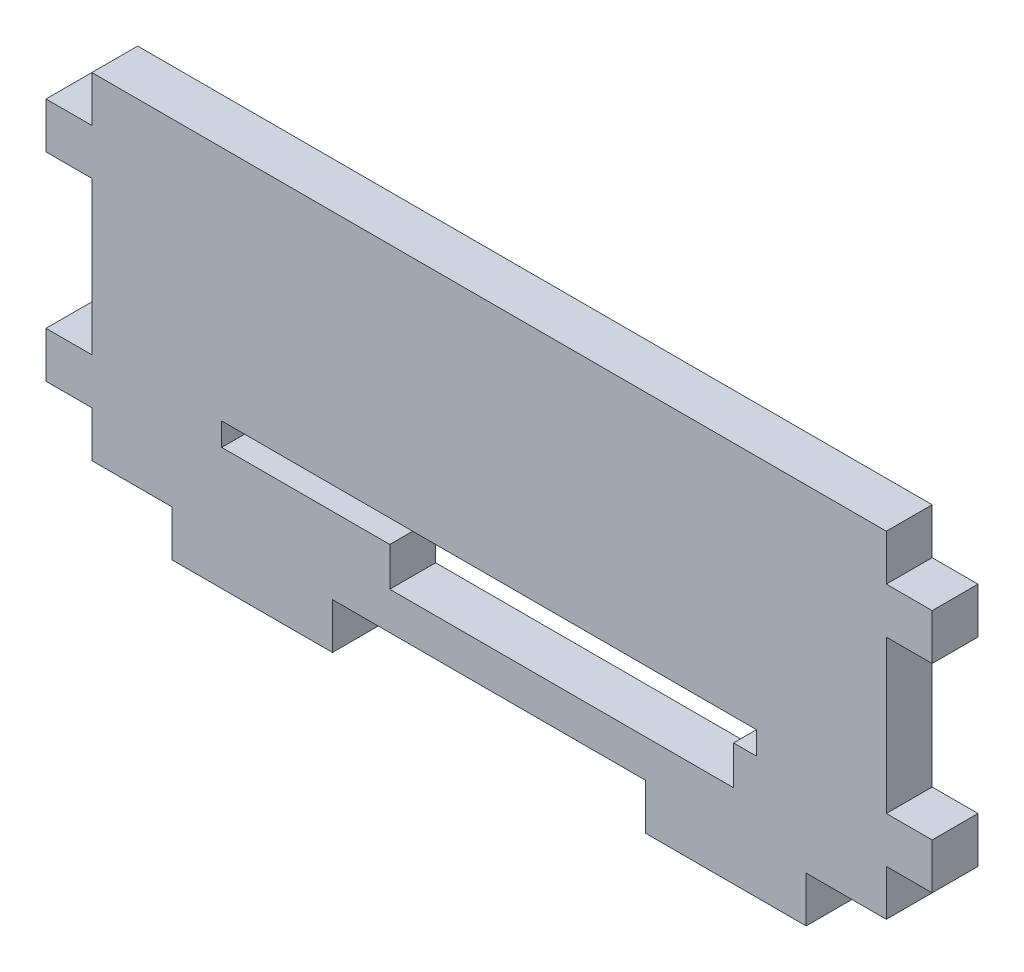
ISO-10303-21;
HEADER;
FILE_DESCRIPTION(('STEP AP214'),'2;1');
FILE_NAME('part.step','',(''),(''),'','','');
FILE_SCHEMA(('AUTOMOTIVE_DESIGN { 1 0 10303 214 1 1 1 1 }'));
ENDSEC;
DATA;
#1=APPLICATION_CONTEXT('core data for automotive mechanical design processes');
#2=APPLICATION_PROTOCOL_DEFINITION('international standard','automotive_design',2000,#1);
#3=PRODUCT_CONTEXT('',#1,'mechanical');
#4=PRODUCT('Part','Part','',(#3));
#5=PRODUCT_RELATED_PRODUCT_CATEGORY('part','',(#4));
#6=PRODUCT_DEFINITION_FORMATION('','',#4);
#7=PRODUCT_DEFINITION_CONTEXT('part definition',#1,'design');
#8=PRODUCT_DEFINITION('design','',#6,#7);
#9=PRODUCT_DEFINITION_SHAPE('','',#8);
#10=(LENGTH_UNIT() NAMED_UNIT(*) SI_UNIT(.MILLI.,.METRE.));
#11=(NAMED_UNIT(*) PLANE_ANGLE_UNIT() SI_UNIT($,.RADIAN.));
#12=(NAMED_UNIT(*) SI_UNIT($,.STERADIAN.) SOLID_ANGLE_UNIT());
#13=UNCERTAINTY_MEASURE_WITH_UNIT(LENGTH_MEASURE(1.E-05),#10,'distance_accuracy_value','');
#14=(GEOMETRIC_REPRESENTATION_CONTEXT(3) GLOBAL_UNCERTAINTY_ASSIGNED_CONTEXT((#13)) GLOBAL_UNIT_ASSIGNED_CONTEXT((#10,
#11,#12)) REPRESENTATION_CONTEXT('',''));
#15=CARTESIAN_POINT('',(0.,0.,0.));
#16=DIRECTION('',(0.,0.,1.));
#17=DIRECTION('',(1.,0.,0.));
#18=AXIS2_PLACEMENT_3D('',#15,#16,#17);
#19=CARTESIAN_POINT('',(-17.5,-6.,0.));
#20=DIRECTION('',(0.,-1.,0.));
#21=DIRECTION('',(0.,0.,-1.));
#22=AXIS2_PLACEMENT_3D('',#19,#20,#21);
#23=PLANE('',#22);
#24=DIRECTION('',(1.,0.,0.));
#25=VECTOR('',#24,1.);
#26=CARTESIAN_POINT('',(-17.5,-6.,3.));
#27=LINE('',#26,#25);
#28=CARTESIAN_POINT('',(-17.5,-6.,3.));
#29=VERTEX_POINT('',#28);
#30=CARTESIAN_POINT('',(-6.50000000000001,-6.,3.));
#31=VERTEX_POINT('',#30);
#32=EDGE_CURVE('E318',#29,#31,#27,.T.);
#33=ORIENTED_EDGE('',*,*,#32,.T.);
#34=DIRECTION('',(0.,0.,1.));
#35=VECTOR('',#34,1.);
#36=CARTESIAN_POINT('',(-6.50000000000001,-6.,0.));
#37=LINE('',#36,#35);
#38=CARTESIAN_POINT('',(-6.50000000000001,-6.,0.));
#39=VERTEX_POINT('',#38);
#40=EDGE_CURVE('E299',#39,#31,#37,.T.);
#41=ORIENTED_EDGE('',*,*,#40,.F.);
#42=DIRECTION('',(1.,0.,0.));
#43=VECTOR('',#42,1.);
#44=CARTESIAN_POINT('',(-17.5,-6.,0.));
#45=LINE('',#44,#43);
#46=CARTESIAN_POINT('',(-17.5,-6.,0.));
#47=VERTEX_POINT('',#46);
#48=EDGE_CURVE('E291',#47,#39,#45,.T.);
#49=ORIENTED_EDGE('',*,*,#48,.F.);
#50=DIRECTION('',(0.,0.,1.));
#51=VECTOR('',#50,1.);
#52=CARTESIAN_POINT('',(-17.5,-6.,0.));
#53=LINE('',#52,#51);
#54=EDGE_CURVE('E315',#47,#29,#53,.T.);
#55=ORIENTED_EDGE('',*,*,#54,.T.);
#56=EDGE_LOOP('',(#33,#41,#49,#55));
#57=FACE_BOUND('',#56,.T.);
#58=ADVANCED_FACE('F33',(#57),#23,.F.);
#59=CARTESIAN_POINT('',(-26.,-11.,3.));
#60=DIRECTION('',(0.,1.,0.));
#61=DIRECTION('',(0.,0.,1.));
#62=AXIS2_PLACEMENT_3D('',#59,#60,#61);
#63=PLANE('',#62);
#64=DIRECTION('',(0.,0.,-1.));
#65=VECTOR('',#64,1.);
#66=CARTESIAN_POINT('',(10.25,-11.,3.));
#67=LINE('',#66,#65);
#68=CARTESIAN_POINT('',(10.25,-11.,3.));
#69=VERTEX_POINT('',#68);
#70=CARTESIAN_POINT('',(10.25,-11.,0.));
#71=VERTEX_POINT('',#70);
#72=EDGE_CURVE('E328',#69,#71,#67,.T.);
#73=ORIENTED_EDGE('',*,*,#72,.F.);
#74=DIRECTION('',(1.,0.,0.));
#75=VECTOR('',#74,1.);
#76=CARTESIAN_POINT('',(-26.,-11.,3.));
#77=LINE('',#76,#75);
#78=CARTESIAN_POINT('',(-10.25,-11.,3.));
#79=VERTEX_POINT('',#78);
#80=EDGE_CURVE('E514',#79,#69,#77,.T.);
#81=ORIENTED_EDGE('',*,*,#80,.F.);
#82=DIRECTION('',(0.,0.,1.));
#83=VECTOR('',#82,1.);
#84=CARTESIAN_POINT('',(-10.25,-11.,3.));
#85=LINE('',#84,#83);
#86=CARTESIAN_POINT('',(-10.25,-11.,0.));
#87=VERTEX_POINT('',#86);
#88=EDGE_CURVE('E366',#87,#79,#85,.T.);
#89=ORIENTED_EDGE('',*,*,#88,.F.);
#90=DIRECTION('',(1.,0.,0.));
#91=VECTOR('',#90,1.);
#92=CARTESIAN_POINT('',(-26.,-11.,0.));
#93=LINE('',#92,#91);
#94=EDGE_CURVE('E527',#87,#71,#93,.T.);
#95=ORIENTED_EDGE('',*,*,#94,.T.);
#96=EDGE_LOOP('',(#73,#81,#89,#95));
#97=FACE_BOUND('',#96,.T.);
#98=ADVANCED_FACE('F608',(#97),#63,.F.);
#99=DIRECTION('',(0.,0.,1.));
#100=VECTOR('',#99,1.);
#101=CARTESIAN_POINT('',(20.75,-11.,3.));
#102=LINE('',#101,#100);
#103=CARTESIAN_POINT('',(20.75,-11.,0.));
#104=VERTEX_POINT('',#103);
#105=CARTESIAN_POINT('',(20.75,-11.,3.));
#106=VERTEX_POINT('',#105);
#107=EDGE_CURVE('E339',#104,#106,#102,.T.);
#108=ORIENTED_EDGE('',*,*,#107,.F.);
#109=CARTESIAN_POINT('',(26.,-11.,0.));
#110=VERTEX_POINT('',#109);
#111=EDGE_CURVE('E523',#104,#110,#93,.T.);
#112=ORIENTED_EDGE('',*,*,#111,.T.);
#113=DIRECTION('',(0.,0.,-1.));
#114=VECTOR('',#113,1.);
#115=CARTESIAN_POINT('',(26.,-11.,3.));
#116=LINE('',#115,#114);
#117=CARTESIAN_POINT('',(26.,-11.,3.));
#118=VERTEX_POINT('',#117);
#119=EDGE_CURVE('E513',#118,#110,#116,.T.);
#120=ORIENTED_EDGE('',*,*,#119,.F.);
#121=EDGE_CURVE('E508',#106,#118,#77,.T.);
#122=ORIENTED_EDGE('',*,*,#121,.F.);
#123=EDGE_LOOP('',(#108,#112,#120,#122));
#124=FACE_BOUND('',#123,.T.);
#125=ADVANCED_FACE('F592',(#124),#63,.F.);
#126=DIRECTION('',(0.,0.,-1.));
#127=VECTOR('',#126,1.);
#128=CARTESIAN_POINT('',(-20.75,-11.,3.));
#129=LINE('',#128,#127);
#130=CARTESIAN_POINT('',(-20.75,-11.,3.));
#131=VERTEX_POINT('',#130);
#132=CARTESIAN_POINT('',(-20.75,-11.,0.));
#133=VERTEX_POINT('',#132);
#134=EDGE_CURVE('E361',#131,#133,#129,.T.);
#135=ORIENTED_EDGE('',*,*,#134,.F.);
#136=CARTESIAN_POINT('',(-26.,-11.,3.));
#137=VERTEX_POINT('',#136);
#138=EDGE_CURVE('E510',#137,#131,#77,.T.);
#139=ORIENTED_EDGE('',*,*,#138,.F.);
#140=DIRECTION('',(0.,0.,-1.));
#141=VECTOR('',#140,1.);
#142=CARTESIAN_POINT('',(-26.,-11.,3.));
#143=LINE('',#142,#141);
#144=CARTESIAN_POINT('',(-26.,-11.,0.));
#145=VERTEX_POINT('',#144);
#146=EDGE_CURVE('E530',#137,#145,#143,.T.);
#147=ORIENTED_EDGE('',*,*,#146,.T.);
#148=EDGE_CURVE('E525',#145,#133,#93,.T.);
#149=ORIENTED_EDGE('',*,*,#148,.T.);
#150=EDGE_LOOP('',(#135,#139,#147,#149));
#151=FACE_BOUND('',#150,.T.);
#152=ADVANCED_FACE('F624',(#151),#63,.F.);
#153=CARTESIAN_POINT('',(26.,11.,3.));
#154=DIRECTION('',(-1.,0.,0.));
#155=DIRECTION('',(0.,0.,1.));
#156=AXIS2_PLACEMENT_3D('',#153,#154,#155);
#157=PLANE('',#156);
#158=DIRECTION('',(0.,0.,-1.));
#159=VECTOR('',#158,1.);
#160=CARTESIAN_POINT('',(26.,-8.,3.));
#161=LINE('',#160,#159);
#162=CARTESIAN_POINT('',(26.,-7.99999999999999,3.));
#163=VERTEX_POINT('',#162);
#164=CARTESIAN_POINT('',(26.,-7.99999999999999,0.));
#165=VERTEX_POINT('',#164);
#166=EDGE_CURVE('E388',#163,#165,#161,.T.);
#167=ORIENTED_EDGE('',*,*,#166,.F.);
#168=DIRECTION('',(0.,1.,0.));
#169=VECTOR('',#168,1.);
#170=CARTESIAN_POINT('',(26.,11.,3.));
#171=LINE('',#170,#169);
#172=EDGE_CURVE('E497',#118,#163,#171,.T.);
#173=ORIENTED_EDGE('',*,*,#172,.F.);
#174=ORIENTED_EDGE('',*,*,#119,.T.);
#175=DIRECTION('',(0.,1.,0.));
#176=VECTOR('',#175,1.);
#177=CARTESIAN_POINT('',(26.,11.,0.));
#178=LINE('',#177,#176);
#179=EDGE_CURVE('E515',#110,#165,#178,.T.);
#180=ORIENTED_EDGE('',*,*,#179,.T.);
#181=EDGE_LOOP('',(#167,#173,#174,#180));
#182=FACE_BOUND('',#181,.T.);
#183=ADVANCED_FACE('F586',(#182),#157,.F.);
#184=DIRECTION('',(0.,0.,1.));
#185=VECTOR('',#184,1.);
#186=CARTESIAN_POINT('',(26.,-5.,3.));
#187=LINE('',#186,#185);
#188=CARTESIAN_POINT('',(26.,-5.,0.));
#189=VERTEX_POINT('',#188);
#190=CARTESIAN_POINT('',(26.,-5.,3.));
#191=VERTEX_POINT('',#190);
#192=EDGE_CURVE('E393',#189,#191,#187,.T.);
#193=ORIENTED_EDGE('',*,*,#192,.F.);
#194=CARTESIAN_POINT('',(26.,5.,0.));
#195=VERTEX_POINT('',#194);
#196=EDGE_CURVE('E518',#189,#195,#178,.T.);
#197=ORIENTED_EDGE('',*,*,#196,.T.);
#198=DIRECTION('',(0.,0.,-1.));
#199=VECTOR('',#198,1.);
#200=CARTESIAN_POINT('',(26.,5.,3.));
#201=LINE('',#200,#199);
#202=CARTESIAN_POINT('',(26.,5.,3.));
#203=VERTEX_POINT('',#202);
#204=EDGE_CURVE('E415',#203,#195,#201,.T.);
#205=ORIENTED_EDGE('',*,*,#204,.F.);
#206=EDGE_CURVE('E501',#191,#203,#171,.T.);
#207=ORIENTED_EDGE('',*,*,#206,.F.);
#208=EDGE_LOOP('',(#193,#197,#205,#207));
#209=FACE_BOUND('',#208,.T.);
#210=ADVANCED_FACE('F560',(#209),#157,.F.);
#211=DIRECTION('',(0.,0.,1.));
#212=VECTOR('',#211,1.);
#213=CARTESIAN_POINT('',(26.,8.,3.));
#214=LINE('',#213,#212);
#215=CARTESIAN_POINT('',(26.,8.,0.));
#216=VERTEX_POINT('',#215);
#217=CARTESIAN_POINT('',(26.,8.,3.));
#218=VERTEX_POINT('',#217);
#219=EDGE_CURVE('E420',#216,#218,#214,.T.);
#220=ORIENTED_EDGE('',*,*,#219,.F.);
#221=CARTESIAN_POINT('',(26.,11.,0.));
#222=VERTEX_POINT('',#221);
#223=EDGE_CURVE('E496',#216,#222,#178,.T.);
#224=ORIENTED_EDGE('',*,*,#223,.T.);
#225=DIRECTION('',(0.,0.,-1.));
#226=VECTOR('',#225,1.);
#227=CARTESIAN_POINT('',(26.,11.,3.));
#228=LINE('',#227,#226);
#229=CARTESIAN_POINT('',(26.,11.,3.));
#230=VERTEX_POINT('',#229);
#231=EDGE_CURVE('E11',#230,#222,#228,.T.);
#232=ORIENTED_EDGE('',*,*,#231,.F.);
#233=EDGE_CURVE('E502',#218,#230,#171,.T.);
#234=ORIENTED_EDGE('',*,*,#233,.F.);
#235=EDGE_LOOP('',(#220,#224,#232,#234));
#236=FACE_BOUND('',#235,.T.);
#237=ADVANCED_FACE('F35',(#236),#157,.F.);
#238=CARTESIAN_POINT('',(-26.,11.,3.));
#239=DIRECTION('',(1.,0.,0.));
#240=DIRECTION('',(0.,1.,0.));
#241=AXIS2_PLACEMENT_3D('',#238,#239,#240);
#242=PLANE('',#241);
#243=DIRECTION('',(0.,0.,1.));
#244=VECTOR('',#243,1.);
#245=CARTESIAN_POINT('',(-26.,-8.,0.));
#246=LINE('',#245,#244);
#247=CARTESIAN_POINT('',(-26.,-8.,0.));
#248=VERTEX_POINT('',#247);
#249=CARTESIAN_POINT('',(-26.,-7.99999999999999,3.));
#250=VERTEX_POINT('',#249);
#251=EDGE_CURVE('E442',#248,#250,#246,.T.);
#252=ORIENTED_EDGE('',*,*,#251,.F.);
#253=DIRECTION('',(0.,-1.,0.));
#254=VECTOR('',#253,1.);
#255=CARTESIAN_POINT('',(-26.,11.,0.));
#256=LINE('',#255,#254);
#257=EDGE_CURVE('E520',#248,#145,#256,.T.);
#258=ORIENTED_EDGE('',*,*,#257,.T.);
#259=ORIENTED_EDGE('',*,*,#146,.F.);
#260=DIRECTION('',(0.,-1.,0.));
#261=VECTOR('',#260,1.);
#262=CARTESIAN_POINT('',(-26.,11.,3.));
#263=LINE('',#262,#261);
#264=EDGE_CURVE('E504',#250,#137,#263,.T.);
#265=ORIENTED_EDGE('',*,*,#264,.F.);
#266=EDGE_LOOP('',(#252,#258,#259,#265));
#267=FACE_BOUND('',#266,.T.);
#268=ADVANCED_FACE('F630',(#267),#242,.F.);
#269=DIRECTION('',(0.,0.,-1.));
#270=VECTOR('',#269,1.);
#271=CARTESIAN_POINT('',(-26.,-5.,0.));
#272=LINE('',#271,#270);
#273=CARTESIAN_POINT('',(-26.,-5.,3.));
#274=VERTEX_POINT('',#273);
#275=CARTESIAN_POINT('',(-26.,-5.,0.));
#276=VERTEX_POINT('',#275);
#277=EDGE_CURVE('E447',#274,#276,#272,.T.);
#278=ORIENTED_EDGE('',*,*,#277,.F.);
#279=CARTESIAN_POINT('',(-26.,5.,3.));
#280=VERTEX_POINT('',#279);
#281=EDGE_CURVE('E509',#280,#274,#263,.T.);
#282=ORIENTED_EDGE('',*,*,#281,.F.);
#283=DIRECTION('',(0.,0.,1.));
#284=VECTOR('',#283,1.);
#285=CARTESIAN_POINT('',(-26.,5.,0.));
#286=LINE('',#285,#284);
#287=CARTESIAN_POINT('',(-26.,5.,0.));
#288=VERTEX_POINT('',#287);
#289=EDGE_CURVE('E469',#288,#280,#286,.T.);
#290=ORIENTED_EDGE('',*,*,#289,.F.);
#291=EDGE_CURVE('E524',#288,#276,#256,.T.);
#292=ORIENTED_EDGE('',*,*,#291,.T.);
#293=EDGE_LOOP('',(#278,#282,#290,#292));
#294=FACE_BOUND('',#293,.T.);
#295=ADVANCED_FACE('F645',(#294),#242,.F.);
#296=DIRECTION('',(0.,0.,-1.));
#297=VECTOR('',#296,1.);
#298=CARTESIAN_POINT('',(-26.,8.,0.));
#299=LINE('',#298,#297);
#300=CARTESIAN_POINT('',(-26.,8.,3.));
#301=VERTEX_POINT('',#300);
#302=CARTESIAN_POINT('',(-26.,8.,0.));
#303=VERTEX_POINT('',#302);
#304=EDGE_CURVE('E474',#301,#303,#299,.T.);
#305=ORIENTED_EDGE('',*,*,#304,.F.);
#306=CARTESIAN_POINT('',(-26.,11.,3.));
#307=VERTEX_POINT('',#306);
#308=EDGE_CURVE('E505',#307,#301,#263,.T.);
#309=ORIENTED_EDGE('',*,*,#308,.F.);
#310=DIRECTION('',(0.,0.,-1.));
#311=VECTOR('',#310,1.);
#312=CARTESIAN_POINT('',(-26.,11.,3.));
#313=LINE('',#312,#311);
#314=CARTESIAN_POINT('',(-26.,11.,0.));
#315=VERTEX_POINT('',#314);
#316=EDGE_CURVE('E41',#307,#315,#313,.T.);
#317=ORIENTED_EDGE('',*,*,#316,.T.);
#318=EDGE_CURVE('E521',#315,#303,#256,.T.);
#319=ORIENTED_EDGE('',*,*,#318,.T.);
#320=EDGE_LOOP('',(#305,#309,#317,#319));
#321=FACE_BOUND('',#320,.T.);
#322=ADVANCED_FACE('F537',(#321),#242,.F.);
#323=CARTESIAN_POINT('',(-26.,11.,3.));
#324=DIRECTION('',(0.,-1.,0.));
#325=DIRECTION('',(0.,0.,-1.));
#326=AXIS2_PLACEMENT_3D('',#323,#324,#325);
#327=PLANE('',#326);
#328=DIRECTION('',(-1.,0.,0.));
#329=VECTOR('',#328,1.);
#330=CARTESIAN_POINT('',(-26.,11.,0.));
#331=LINE('',#330,#329);
#332=EDGE_CURVE('E517',#222,#315,#331,.T.);
#333=ORIENTED_EDGE('',*,*,#332,.T.);
#334=ORIENTED_EDGE('',*,*,#316,.F.);
#335=DIRECTION('',(-1.,0.,0.));
#336=VECTOR('',#335,1.);
#337=CARTESIAN_POINT('',(-26.,11.,3.));
#338=LINE('',#337,#336);
#339=EDGE_CURVE('E500',#230,#307,#338,.T.);
#340=ORIENTED_EDGE('',*,*,#339,.F.);
#341=ORIENTED_EDGE('',*,*,#231,.T.);
#342=EDGE_LOOP('',(#333,#334,#340,#341));
#343=FACE_BOUND('',#342,.T.);
#344=ADVANCED_FACE('F554',(#343),#327,.F.);
#345=CARTESIAN_POINT('',(0.,0.,3.));
#346=DIRECTION('',(0.,0.,1.));
#347=DIRECTION('',(1.,0.,0.));
#348=AXIS2_PLACEMENT_3D('',#345,#346,#347);
#349=PLANE('',#348);
#350=DIRECTION('',(0.,-1.,0.));
#351=VECTOR('',#350,1.);
#352=CARTESIAN_POINT('',(-6.50000000000001,-6.,3.));
#353=LINE('',#352,#351);
#354=CARTESIAN_POINT('',(-6.50000000000001,-8.53915191363974,3.));
#355=VERTEX_POINT('',#354);
#356=EDGE_CURVE('E272',#31,#355,#353,.T.);
#357=ORIENTED_EDGE('',*,*,#356,.F.);
#358=ORIENTED_EDGE('',*,*,#32,.F.);
#359=DIRECTION('',(0.,-1.,0.));
#360=VECTOR('',#359,1.);
#361=CARTESIAN_POINT('',(-17.5,-4.5,3.));
#362=LINE('',#361,#360);
#363=CARTESIAN_POINT('',(-17.5,-4.5,3.));
#364=VERTEX_POINT('',#363);
#365=EDGE_CURVE('E56',#364,#29,#362,.T.);
#366=ORIENTED_EDGE('',*,*,#365,.F.);
#367=DIRECTION('',(-1.,0.,0.));
#368=VECTOR('',#367,1.);
#369=CARTESIAN_POINT('',(-17.5,-4.5,3.));
#370=LINE('',#369,#368);
#371=CARTESIAN_POINT('',(17.5,-4.5,3.));
#372=VERTEX_POINT('',#371);
#373=EDGE_CURVE('E307',#372,#364,#370,.T.);
#374=ORIENTED_EDGE('',*,*,#373,.F.);
#375=DIRECTION('',(0.,1.,0.));
#376=VECTOR('',#375,1.);
#377=CARTESIAN_POINT('',(17.5,-4.5,3.));
#378=LINE('',#377,#376);
#379=CARTESIAN_POINT('',(17.5,-6.,3.));
#380=VERTEX_POINT('',#379);
#381=EDGE_CURVE('E321',#380,#372,#378,.T.);
#382=ORIENTED_EDGE('',*,*,#381,.F.);
#383=CARTESIAN_POINT('',(16.,-6.,3.));
#384=VERTEX_POINT('',#383);
#385=EDGE_CURVE('E317',#384,#380,#27,.T.);
#386=ORIENTED_EDGE('',*,*,#385,.F.);
#387=DIRECTION('',(0.,1.,0.));
#388=VECTOR('',#387,1.);
#389=CARTESIAN_POINT('',(16.,-6.,3.));
#390=LINE('',#389,#388);
#391=CARTESIAN_POINT('',(16.,-8.53915191363974,3.));
#392=VERTEX_POINT('',#391);
#393=EDGE_CURVE('E48',#392,#384,#390,.T.);
#394=ORIENTED_EDGE('',*,*,#393,.F.);
#395=DIRECTION('',(1.,0.,0.));
#396=VECTOR('',#395,1.);
#397=CARTESIAN_POINT('',(-6.50000000000001,-8.53915191363974,3.));
#398=LINE('',#397,#396);
#399=EDGE_CURVE('E293',#355,#392,#398,.T.);
#400=ORIENTED_EDGE('',*,*,#399,.F.);
#401=EDGE_LOOP('',(#357,#358,#366,#374,#382,#386,#394,#400));
#402=FACE_BOUND('',#401,.T.);
#403=ORIENTED_EDGE('',*,*,#172,.T.);
#404=DIRECTION('',(-1.,0.,0.));
#405=VECTOR('',#404,1.);
#406=CARTESIAN_POINT('',(29.,-8.,3.));
#407=LINE('',#406,#405);
#408=CARTESIAN_POINT('',(29.,-8.,3.));
#409=VERTEX_POINT('',#408);
#410=EDGE_CURVE('E412',#409,#163,#407,.T.);
#411=ORIENTED_EDGE('',*,*,#410,.F.);
#412=DIRECTION('',(0.,-1.,0.));
#413=VECTOR('',#412,1.);
#414=CARTESIAN_POINT('',(29.,-5.,3.));
#415=LINE('',#414,#413);
#416=CARTESIAN_POINT('',(29.,-5.,3.));
#417=VERTEX_POINT('',#416);
#418=EDGE_CURVE('E389',#417,#409,#415,.T.);
#419=ORIENTED_EDGE('',*,*,#418,.F.);
#420=DIRECTION('',(-1.,0.,0.));
#421=VECTOR('',#420,1.);
#422=CARTESIAN_POINT('',(29.,-5.,3.));
#423=LINE('',#422,#421);
#424=EDGE_CURVE('E399',#417,#191,#423,.T.);
#425=ORIENTED_EDGE('',*,*,#424,.T.);
#426=ORIENTED_EDGE('',*,*,#206,.T.);
#427=DIRECTION('',(-1.,0.,0.));
#428=VECTOR('',#427,1.);
#429=CARTESIAN_POINT('',(29.,5.,3.));
#430=LINE('',#429,#428);
#431=CARTESIAN_POINT('',(29.,5.,3.));
#432=VERTEX_POINT('',#431);
#433=EDGE_CURVE('E439',#432,#203,#430,.T.);
#434=ORIENTED_EDGE('',*,*,#433,.F.);
#435=DIRECTION('',(0.,-1.,0.));
#436=VECTOR('',#435,1.);
#437=CARTESIAN_POINT('',(29.,8.,3.));
#438=LINE('',#437,#436);
#439=CARTESIAN_POINT('',(29.,8.,3.));
#440=VERTEX_POINT('',#439);
#441=EDGE_CURVE('E416',#440,#432,#438,.T.);
#442=ORIENTED_EDGE('',*,*,#441,.F.);
#443=DIRECTION('',(-1.,0.,0.));
#444=VECTOR('',#443,1.);
#445=CARTESIAN_POINT('',(29.,8.,3.));
#446=LINE('',#445,#444);
#447=EDGE_CURVE('E426',#440,#218,#446,.T.);
#448=ORIENTED_EDGE('',*,*,#447,.T.);
#449=ORIENTED_EDGE('',*,*,#233,.T.);
#450=ORIENTED_EDGE('',*,*,#339,.T.);
#451=ORIENTED_EDGE('',*,*,#308,.T.);
#452=DIRECTION('',(1.,0.,0.));
#453=VECTOR('',#452,1.);
#454=CARTESIAN_POINT('',(-29.,8.,3.));
#455=LINE('',#454,#453);
#456=CARTESIAN_POINT('',(-29.,8.,3.));
#457=VERTEX_POINT('',#456);
#458=EDGE_CURVE('E487',#457,#301,#455,.T.);
#459=ORIENTED_EDGE('',*,*,#458,.F.);
#460=DIRECTION('',(0.,1.,0.));
#461=VECTOR('',#460,1.);
#462=CARTESIAN_POINT('',(-29.,8.,3.));
#463=LINE('',#462,#461);
#464=CARTESIAN_POINT('',(-29.,5.,3.));
#465=VERTEX_POINT('',#464);
#466=EDGE_CURVE('E476',#465,#457,#463,.T.);
#467=ORIENTED_EDGE('',*,*,#466,.F.);
#468=DIRECTION('',(1.,0.,0.));
#469=VECTOR('',#468,1.);
#470=CARTESIAN_POINT('',(-29.,5.,3.));
#471=LINE('',#470,#469);
#472=EDGE_CURVE('E490',#465,#280,#471,.T.);
#473=ORIENTED_EDGE('',*,*,#472,.T.);
#474=ORIENTED_EDGE('',*,*,#281,.T.);
#475=DIRECTION('',(1.,0.,0.));
#476=VECTOR('',#475,1.);
#477=CARTESIAN_POINT('',(-29.,-5.,3.));
#478=LINE('',#477,#476);
#479=CARTESIAN_POINT('',(-29.,-5.,3.));
#480=VERTEX_POINT('',#479);
#481=EDGE_CURVE('E460',#480,#274,#478,.T.);
#482=ORIENTED_EDGE('',*,*,#481,.F.);
#483=DIRECTION('',(0.,1.,0.));
#484=VECTOR('',#483,1.);
#485=CARTESIAN_POINT('',(-29.,-5.,3.));
#486=LINE('',#485,#484);
#487=CARTESIAN_POINT('',(-29.,-7.99999999999999,3.));
#488=VERTEX_POINT('',#487);
#489=EDGE_CURVE('E449',#488,#480,#486,.T.);
#490=ORIENTED_EDGE('',*,*,#489,.F.);
#491=DIRECTION('',(1.,0.,0.));
#492=VECTOR('',#491,1.);
#493=CARTESIAN_POINT('',(-29.,-7.99999999999999,3.));
#494=LINE('',#493,#492);
#495=EDGE_CURVE('E463',#488,#250,#494,.T.);
#496=ORIENTED_EDGE('',*,*,#495,.T.);
#497=ORIENTED_EDGE('',*,*,#264,.T.);
#498=ORIENTED_EDGE('',*,*,#138,.T.);
#499=DIRECTION('',(0.,1.,0.));
#500=VECTOR('',#499,1.);
#501=CARTESIAN_POINT('',(-20.75,-14.,3.));
#502=LINE('',#501,#500);
#503=CARTESIAN_POINT('',(-20.75,-14.,3.));
#504=VERTEX_POINT('',#503);
#505=EDGE_CURVE('E372',#504,#131,#502,.T.);
#506=ORIENTED_EDGE('',*,*,#505,.F.);
#507=DIRECTION('',(-1.,0.,0.));
#508=VECTOR('',#507,1.);
#509=CARTESIAN_POINT('',(-20.75,-14.,3.));
#510=LINE('',#509,#508);
#511=CARTESIAN_POINT('',(-10.25,-14.,3.));
#512=VERTEX_POINT('',#511);
#513=EDGE_CURVE('E370',#512,#504,#510,.T.);
#514=ORIENTED_EDGE('',*,*,#513,.F.);
#515=DIRECTION('',(0.,1.,0.));
#516=VECTOR('',#515,1.);
#517=CARTESIAN_POINT('',(-10.25,-14.,3.));
#518=LINE('',#517,#516);
#519=EDGE_CURVE('E379',#512,#79,#518,.T.);
#520=ORIENTED_EDGE('',*,*,#519,.T.);
#521=ORIENTED_EDGE('',*,*,#80,.T.);
#522=DIRECTION('',(0.,1.,0.));
#523=VECTOR('',#522,1.);
#524=CARTESIAN_POINT('',(10.25,-14.,3.));
#525=LINE('',#524,#523);
#526=CARTESIAN_POINT('',(10.25,-14.,3.));
#527=VERTEX_POINT('',#526);
#528=EDGE_CURVE('E345',#527,#69,#525,.T.);
#529=ORIENTED_EDGE('',*,*,#528,.F.);
#530=DIRECTION('',(-1.,0.,0.));
#531=VECTOR('',#530,1.);
#532=CARTESIAN_POINT('',(10.25,-14.,3.));
#533=LINE('',#532,#531);
#534=CARTESIAN_POINT('',(20.75,-14.,3.));
#535=VERTEX_POINT('',#534);
#536=EDGE_CURVE('E343',#535,#527,#533,.T.);
#537=ORIENTED_EDGE('',*,*,#536,.F.);
#538=DIRECTION('',(0.,1.,0.));
#539=VECTOR('',#538,1.);
#540=CARTESIAN_POINT('',(20.75,-14.,3.));
#541=LINE('',#540,#539);
#542=EDGE_CURVE('E352',#535,#106,#541,.T.);
#543=ORIENTED_EDGE('',*,*,#542,.T.);
#544=ORIENTED_EDGE('',*,*,#121,.T.);
#545=EDGE_LOOP('',(#403,#411,#419,#425,#426,#434,#442,#448,#449,#450,#451,#459,#467,#473,#474,
#482,#490,#496,#497,#498,#506,#514,#520,#521,#529,#537,#543,#544));
#546=FACE_BOUND('',#545,.T.);
#547=ADVANCED_FACE('F551',(#402,#546),#349,.T.);
#548=CARTESIAN_POINT('',(0.,0.,0.));
#549=DIRECTION('',(0.,0.,1.));
#550=DIRECTION('',(1.,0.,0.));
#551=AXIS2_PLACEMENT_3D('',#548,#549,#550);
#552=PLANE('',#551);
#553=ORIENTED_EDGE('',*,*,#48,.T.);
#554=DIRECTION('',(0.,-1.,0.));
#555=VECTOR('',#554,1.);
#556=CARTESIAN_POINT('',(-6.50000000000001,-6.,0.));
#557=LINE('',#556,#555);
#558=CARTESIAN_POINT('',(-6.50000000000001,-8.53915191363974,0.));
#559=VERTEX_POINT('',#558);
#560=EDGE_CURVE('E269',#39,#559,#557,.T.);
#561=ORIENTED_EDGE('',*,*,#560,.T.);
#562=DIRECTION('',(1.,0.,0.));
#563=VECTOR('',#562,1.);
#564=CARTESIAN_POINT('',(-6.50000000000001,-8.53915191363974,0.));
#565=LINE('',#564,#563);
#566=CARTESIAN_POINT('',(16.,-8.53915191363974,0.));
#567=VERTEX_POINT('',#566);
#568=EDGE_CURVE('E280',#559,#567,#565,.T.);
#569=ORIENTED_EDGE('',*,*,#568,.T.);
#570=DIRECTION('',(0.,1.,0.));
#571=VECTOR('',#570,1.);
#572=CARTESIAN_POINT('',(16.,-6.,0.));
#573=LINE('',#572,#571);
#574=CARTESIAN_POINT('',(16.,-6.,0.));
#575=VERTEX_POINT('',#574);
#576=EDGE_CURVE('E277',#567,#575,#573,.T.);
#577=ORIENTED_EDGE('',*,*,#576,.T.);
#578=CARTESIAN_POINT('',(17.5,-6.,0.));
#579=VERTEX_POINT('',#578);
#580=EDGE_CURVE('E306',#575,#579,#45,.T.);
#581=ORIENTED_EDGE('',*,*,#580,.T.);
#582=DIRECTION('',(0.,1.,0.));
#583=VECTOR('',#582,1.);
#584=CARTESIAN_POINT('',(17.5,-4.5,0.));
#585=LINE('',#584,#583);
#586=CARTESIAN_POINT('',(17.5,-4.5,0.));
#587=VERTEX_POINT('',#586);
#588=EDGE_CURVE('E309',#579,#587,#585,.T.);
#589=ORIENTED_EDGE('',*,*,#588,.T.);
#590=DIRECTION('',(-1.,0.,0.));
#591=VECTOR('',#590,1.);
#592=CARTESIAN_POINT('',(-17.5,-4.5,0.));
#593=LINE('',#592,#591);
#594=CARTESIAN_POINT('',(-17.5,-4.5,0.));
#595=VERTEX_POINT('',#594);
#596=EDGE_CURVE('E312',#587,#595,#593,.T.);
#597=ORIENTED_EDGE('',*,*,#596,.T.);
#598=DIRECTION('',(0.,-1.,0.));
#599=VECTOR('',#598,1.);
#600=CARTESIAN_POINT('',(-17.5,-4.5,0.));
#601=LINE('',#600,#599);
#602=EDGE_CURVE('E304',#595,#47,#601,.T.);
#603=ORIENTED_EDGE('',*,*,#602,.T.);
#604=EDGE_LOOP('',(#553,#561,#569,#577,#581,#589,#597,#603));
#605=FACE_BOUND('',#604,.T.);
#606=ORIENTED_EDGE('',*,*,#179,.F.);
#607=ORIENTED_EDGE('',*,*,#111,.F.);
#608=DIRECTION('',(0.,1.,0.));
#609=VECTOR('',#608,1.);
#610=CARTESIAN_POINT('',(20.75,-14.,0.));
#611=LINE('',#610,#609);
#612=CARTESIAN_POINT('',(20.75,-14.,0.));
#613=VERTEX_POINT('',#612);
#614=EDGE_CURVE('E355',#613,#104,#611,.T.);
#615=ORIENTED_EDGE('',*,*,#614,.F.);
#616=DIRECTION('',(1.,0.,0.));
#617=VECTOR('',#616,1.);
#618=CARTESIAN_POINT('',(10.25,-14.,0.));
#619=LINE('',#618,#617);
#620=CARTESIAN_POINT('',(10.25,-14.,0.));
#621=VERTEX_POINT('',#620);
#622=EDGE_CURVE('E338',#621,#613,#619,.T.);
#623=ORIENTED_EDGE('',*,*,#622,.F.);
#624=DIRECTION('',(0.,1.,0.));
#625=VECTOR('',#624,1.);
#626=CARTESIAN_POINT('',(10.25,-14.,0.));
#627=LINE('',#626,#625);
#628=EDGE_CURVE('E358',#621,#71,#627,.T.);
#629=ORIENTED_EDGE('',*,*,#628,.T.);
#630=ORIENTED_EDGE('',*,*,#94,.F.);
#631=DIRECTION('',(0.,1.,0.));
#632=VECTOR('',#631,1.);
#633=CARTESIAN_POINT('',(-10.25,-14.,0.));
#634=LINE('',#633,#632);
#635=CARTESIAN_POINT('',(-10.25,-14.,0.));
#636=VERTEX_POINT('',#635);
#637=EDGE_CURVE('E382',#636,#87,#634,.T.);
#638=ORIENTED_EDGE('',*,*,#637,.F.);
#639=DIRECTION('',(1.,0.,0.));
#640=VECTOR('',#639,1.);
#641=CARTESIAN_POINT('',(-20.75,-14.,0.));
#642=LINE('',#641,#640);
#643=CARTESIAN_POINT('',(-20.75,-14.,0.));
#644=VERTEX_POINT('',#643);
#645=EDGE_CURVE('E365',#644,#636,#642,.T.);
#646=ORIENTED_EDGE('',*,*,#645,.F.);
#647=DIRECTION('',(0.,1.,0.));
#648=VECTOR('',#647,1.);
#649=CARTESIAN_POINT('',(-20.75,-14.,0.));
#650=LINE('',#649,#648);
#651=EDGE_CURVE('E385',#644,#133,#650,.T.);
#652=ORIENTED_EDGE('',*,*,#651,.T.);
#653=ORIENTED_EDGE('',*,*,#148,.F.);
#654=ORIENTED_EDGE('',*,*,#257,.F.);
#655=DIRECTION('',(1.,0.,0.));
#656=VECTOR('',#655,1.);
#657=CARTESIAN_POINT('',(-29.,-8.,0.));
#658=LINE('',#657,#656);
#659=CARTESIAN_POINT('',(-29.,-8.,0.));
#660=VERTEX_POINT('',#659);
#661=EDGE_CURVE('E466',#660,#248,#658,.T.);
#662=ORIENTED_EDGE('',*,*,#661,.F.);
#663=DIRECTION('',(0.,-1.,0.));
#664=VECTOR('',#663,1.);
#665=CARTESIAN_POINT('',(-29.,-5.,0.));
#666=LINE('',#665,#664);
#667=CARTESIAN_POINT('',(-29.,-5.,0.));
#668=VERTEX_POINT('',#667);
#669=EDGE_CURVE('E443',#668,#660,#666,.T.);
#670=ORIENTED_EDGE('',*,*,#669,.F.);
#671=DIRECTION('',(1.,0.,0.));
#672=VECTOR('',#671,1.);
#673=CARTESIAN_POINT('',(-29.,-5.,0.));
#674=LINE('',#673,#672);
#675=EDGE_CURVE('E453',#668,#276,#674,.T.);
#676=ORIENTED_EDGE('',*,*,#675,.T.);
#677=ORIENTED_EDGE('',*,*,#291,.F.);
#678=DIRECTION('',(1.,0.,0.));
#679=VECTOR('',#678,1.);
#680=CARTESIAN_POINT('',(-29.,5.,0.));
#681=LINE('',#680,#679);
#682=CARTESIAN_POINT('',(-29.,5.,0.));
#683=VERTEX_POINT('',#682);
#684=EDGE_CURVE('E493',#683,#288,#681,.T.);
#685=ORIENTED_EDGE('',*,*,#684,.F.);
#686=DIRECTION('',(0.,-1.,0.));
#687=VECTOR('',#686,1.);
#688=CARTESIAN_POINT('',(-29.,8.,0.));
#689=LINE('',#688,#687);
#690=CARTESIAN_POINT('',(-29.,8.,0.));
#691=VERTEX_POINT('',#690);
#692=EDGE_CURVE('E470',#691,#683,#689,.T.);
#693=ORIENTED_EDGE('',*,*,#692,.F.);
#694=DIRECTION('',(1.,0.,0.));
#695=VECTOR('',#694,1.);
#696=CARTESIAN_POINT('',(-29.,8.,0.));
#697=LINE('',#696,#695);
#698=EDGE_CURVE('E480',#691,#303,#697,.T.);
#699=ORIENTED_EDGE('',*,*,#698,.T.);
#700=ORIENTED_EDGE('',*,*,#318,.F.);
#701=ORIENTED_EDGE('',*,*,#332,.F.);
#702=ORIENTED_EDGE('',*,*,#223,.F.);
#703=DIRECTION('',(-1.,0.,0.));
#704=VECTOR('',#703,1.);
#705=CARTESIAN_POINT('',(29.,8.,0.));
#706=LINE('',#705,#704);
#707=CARTESIAN_POINT('',(29.,8.,0.));
#708=VERTEX_POINT('',#707);
#709=EDGE_CURVE('E433',#708,#216,#706,.T.);
#710=ORIENTED_EDGE('',*,*,#709,.F.);
#711=DIRECTION('',(0.,1.,0.));
#712=VECTOR('',#711,1.);
#713=CARTESIAN_POINT('',(29.,8.,0.));
#714=LINE('',#713,#712);
#715=CARTESIAN_POINT('',(29.,5.,0.));
#716=VERTEX_POINT('',#715);
#717=EDGE_CURVE('E422',#716,#708,#714,.T.);
#718=ORIENTED_EDGE('',*,*,#717,.F.);
#719=DIRECTION('',(-1.,0.,0.));
#720=VECTOR('',#719,1.);
#721=CARTESIAN_POINT('',(29.,5.,0.));
#722=LINE('',#721,#720);
#723=EDGE_CURVE('E436',#716,#195,#722,.T.);
#724=ORIENTED_EDGE('',*,*,#723,.T.);
#725=ORIENTED_EDGE('',*,*,#196,.F.);
#726=DIRECTION('',(-1.,0.,0.));
#727=VECTOR('',#726,1.);
#728=CARTESIAN_POINT('',(29.,-5.,0.));
#729=LINE('',#728,#727);
#730=CARTESIAN_POINT('',(29.,-5.,0.));
#731=VERTEX_POINT('',#730);
#732=EDGE_CURVE('E406',#731,#189,#729,.T.);
#733=ORIENTED_EDGE('',*,*,#732,.F.);
#734=DIRECTION('',(0.,1.,0.));
#735=VECTOR('',#734,1.);
#736=CARTESIAN_POINT('',(29.,-5.,0.));
#737=LINE('',#736,#735);
#738=CARTESIAN_POINT('',(29.,-8.,0.));
#739=VERTEX_POINT('',#738);
#740=EDGE_CURVE('E395',#739,#731,#737,.T.);
#741=ORIENTED_EDGE('',*,*,#740,.F.);
#742=DIRECTION('',(-1.,0.,0.));
#743=VECTOR('',#742,1.);
#744=CARTESIAN_POINT('',(29.,-8.,0.));
#745=LINE('',#744,#743);
#746=EDGE_CURVE('E409',#739,#165,#745,.T.);
#747=ORIENTED_EDGE('',*,*,#746,.T.);
#748=EDGE_LOOP('',(#606,#607,#615,#623,#629,#630,#638,#646,#652,#653,#654,#662,#670,#676,#677,
#685,#693,#699,#700,#701,#702,#710,#718,#724,#725,#733,#741,#747));
#749=FACE_BOUND('',#748,.T.);
#750=ADVANCED_FACE('F287',(#605,#749),#552,.F.);
#751=CARTESIAN_POINT('',(-29.,5.,0.));
#752=DIRECTION('',(0.,1.,0.));
#753=DIRECTION('',(-1.,0.,0.));
#754=AXIS2_PLACEMENT_3D('',#751,#752,#753);
#755=PLANE('',#754);
#756=ORIENTED_EDGE('',*,*,#289,.T.);
#757=ORIENTED_EDGE('',*,*,#472,.F.);
#758=DIRECTION('',(0.,0.,1.));
#759=VECTOR('',#758,1.);
#760=CARTESIAN_POINT('',(-29.,5.,0.));
#761=LINE('',#760,#759);
#762=EDGE_CURVE('E473',#683,#465,#761,.T.);
#763=ORIENTED_EDGE('',*,*,#762,.F.);
#764=ORIENTED_EDGE('',*,*,#684,.T.);
#765=EDGE_LOOP('',(#756,#757,#763,#764));
#766=FACE_BOUND('',#765,.T.);
#767=ADVANCED_FACE('F648',(#766),#755,.F.);
#768=CARTESIAN_POINT('',(-29.,8.,0.));
#769=DIRECTION('',(0.,-1.,0.));
#770=DIRECTION('',(1.,0.,0.));
#771=AXIS2_PLACEMENT_3D('',#768,#769,#770);
#772=PLANE('',#771);
#773=ORIENTED_EDGE('',*,*,#304,.T.);
#774=ORIENTED_EDGE('',*,*,#698,.F.);
#775=DIRECTION('',(0.,0.,-1.));
#776=VECTOR('',#775,1.);
#777=CARTESIAN_POINT('',(-29.,8.,0.));
#778=LINE('',#777,#776);
#779=EDGE_CURVE('E478',#457,#691,#778,.T.);
#780=ORIENTED_EDGE('',*,*,#779,.F.);
#781=ORIENTED_EDGE('',*,*,#458,.T.);
#782=EDGE_LOOP('',(#773,#774,#780,#781));
#783=FACE_BOUND('',#782,.T.);
#784=ADVANCED_FACE('F548',(#783),#772,.F.);
#785=CARTESIAN_POINT('',(-29.,0.,0.));
#786=DIRECTION('',(-1.,0.,0.));
#787=DIRECTION('',(0.,0.,1.));
#788=AXIS2_PLACEMENT_3D('',#785,#786,#787);
#789=PLANE('',#788);
#790=ORIENTED_EDGE('',*,*,#692,.T.);
#791=ORIENTED_EDGE('',*,*,#762,.T.);
#792=ORIENTED_EDGE('',*,*,#466,.T.);
#793=ORIENTED_EDGE('',*,*,#779,.T.);
#794=EDGE_LOOP('',(#790,#791,#792,#793));
#795=FACE_BOUND('',#794,.T.);
#796=ADVANCED_FACE('F650',(#795),#789,.T.);
#797=CARTESIAN_POINT('',(-29.,-8.,0.));
#798=DIRECTION('',(0.,1.,0.));
#799=DIRECTION('',(0.,0.,1.));
#800=AXIS2_PLACEMENT_3D('',#797,#798,#799);
#801=PLANE('',#800);
#802=ORIENTED_EDGE('',*,*,#251,.T.);
#803=ORIENTED_EDGE('',*,*,#495,.F.);
#804=DIRECTION('',(0.,0.,1.));
#805=VECTOR('',#804,1.);
#806=CARTESIAN_POINT('',(-29.,-8.,0.));
#807=LINE('',#806,#805);
#808=EDGE_CURVE('E446',#660,#488,#807,.T.);
#809=ORIENTED_EDGE('',*,*,#808,.F.);
#810=ORIENTED_EDGE('',*,*,#661,.T.);
#811=EDGE_LOOP('',(#802,#803,#809,#810));
#812=FACE_BOUND('',#811,.T.);
#813=ADVANCED_FACE('F634',(#812),#801,.F.);
#814=CARTESIAN_POINT('',(-29.,-5.,0.));
#815=DIRECTION('',(0.,-1.,0.));
#816=DIRECTION('',(0.,0.,-1.));
#817=AXIS2_PLACEMENT_3D('',#814,#815,#816);
#818=PLANE('',#817);
#819=ORIENTED_EDGE('',*,*,#277,.T.);
#820=ORIENTED_EDGE('',*,*,#675,.F.);
#821=DIRECTION('',(0.,0.,-1.));
#822=VECTOR('',#821,1.);
#823=CARTESIAN_POINT('',(-29.,-5.,0.));
#824=LINE('',#823,#822);
#825=EDGE_CURVE('E451',#480,#668,#824,.T.);
#826=ORIENTED_EDGE('',*,*,#825,.F.);
#827=ORIENTED_EDGE('',*,*,#481,.T.);
#828=EDGE_LOOP('',(#819,#820,#826,#827));
#829=FACE_BOUND('',#828,.T.);
#830=ADVANCED_FACE('F641',(#829),#818,.F.);
#831=CARTESIAN_POINT('',(-29.,0.,0.));
#832=DIRECTION('',(-1.,0.,0.));
#833=DIRECTION('',(0.,0.,1.));
#834=AXIS2_PLACEMENT_3D('',#831,#832,#833);
#835=PLANE('',#834);
#836=ORIENTED_EDGE('',*,*,#669,.T.);
#837=ORIENTED_EDGE('',*,*,#808,.T.);
#838=ORIENTED_EDGE('',*,*,#489,.T.);
#839=ORIENTED_EDGE('',*,*,#825,.T.);
#840=EDGE_LOOP('',(#836,#837,#838,#839));
#841=FACE_BOUND('',#840,.T.);
#842=ADVANCED_FACE('F636',(#841),#835,.T.);
#843=CARTESIAN_POINT('',(29.,5.,3.));
#844=DIRECTION('',(0.,1.,0.));
#845=DIRECTION('',(0.,0.,1.));
#846=AXIS2_PLACEMENT_3D('',#843,#844,#845);
#847=PLANE('',#846);
#848=ORIENTED_EDGE('',*,*,#204,.T.);
#849=ORIENTED_EDGE('',*,*,#723,.F.);
#850=DIRECTION('',(0.,0.,-1.));
#851=VECTOR('',#850,1.);
#852=CARTESIAN_POINT('',(29.,5.,3.));
#853=LINE('',#852,#851);
#854=EDGE_CURVE('E419',#432,#716,#853,.T.);
#855=ORIENTED_EDGE('',*,*,#854,.F.);
#856=ORIENTED_EDGE('',*,*,#433,.T.);
#857=EDGE_LOOP('',(#848,#849,#855,#856));
#858=FACE_BOUND('',#857,.T.);
#859=ADVANCED_FACE('F564',(#858),#847,.F.);
#860=CARTESIAN_POINT('',(29.,8.,3.));
#861=DIRECTION('',(0.,-1.,0.));
#862=DIRECTION('',(0.,0.,-1.));
#863=AXIS2_PLACEMENT_3D('',#860,#861,#862);
#864=PLANE('',#863);
#865=ORIENTED_EDGE('',*,*,#219,.T.);
#866=ORIENTED_EDGE('',*,*,#447,.F.);
#867=DIRECTION('',(0.,0.,1.));
#868=VECTOR('',#867,1.);
#869=CARTESIAN_POINT('',(29.,8.,3.));
#870=LINE('',#869,#868);
#871=EDGE_CURVE('E424',#708,#440,#870,.T.);
#872=ORIENTED_EDGE('',*,*,#871,.F.);
#873=ORIENTED_EDGE('',*,*,#709,.T.);
#874=EDGE_LOOP('',(#865,#866,#872,#873));
#875=FACE_BOUND('',#874,.T.);
#876=ADVANCED_FACE('F740',(#875),#864,.F.);
#877=CARTESIAN_POINT('',(29.,0.,0.));
#878=DIRECTION('',(1.,0.,0.));
#879=DIRECTION('',(0.,0.,-1.));
#880=AXIS2_PLACEMENT_3D('',#877,#878,#879);
#881=PLANE('',#880);
#882=ORIENTED_EDGE('',*,*,#441,.T.);
#883=ORIENTED_EDGE('',*,*,#854,.T.);
#884=ORIENTED_EDGE('',*,*,#717,.T.);
#885=ORIENTED_EDGE('',*,*,#871,.T.);
#886=EDGE_LOOP('',(#882,#883,#884,#885));
#887=FACE_BOUND('',#886,.T.);
#888=ADVANCED_FACE('F569',(#887),#881,.T.);
#889=CARTESIAN_POINT('',(29.,-8.,3.));
#890=DIRECTION('',(0.,1.,0.));
#891=DIRECTION('',(0.,0.,1.));
#892=AXIS2_PLACEMENT_3D('',#889,#890,#891);
#893=PLANE('',#892);
#894=ORIENTED_EDGE('',*,*,#166,.T.);
#895=ORIENTED_EDGE('',*,*,#746,.F.);
#896=DIRECTION('',(0.,0.,-1.));
#897=VECTOR('',#896,1.);
#898=CARTESIAN_POINT('',(29.,-8.,3.));
#899=LINE('',#898,#897);
#900=EDGE_CURVE('E392',#409,#739,#899,.T.);
#901=ORIENTED_EDGE('',*,*,#900,.F.);
#902=ORIENTED_EDGE('',*,*,#410,.T.);
#903=EDGE_LOOP('',(#894,#895,#901,#902));
#904=FACE_BOUND('',#903,.T.);
#905=ADVANCED_FACE('F583',(#904),#893,.F.);
#906=CARTESIAN_POINT('',(29.,-5.,3.));
#907=DIRECTION('',(0.,-1.,0.));
#908=DIRECTION('',(0.,0.,-1.));
#909=AXIS2_PLACEMENT_3D('',#906,#907,#908);
#910=PLANE('',#909);
#911=ORIENTED_EDGE('',*,*,#192,.T.);
#912=ORIENTED_EDGE('',*,*,#424,.F.);
#913=DIRECTION('',(0.,0.,1.));
#914=VECTOR('',#913,1.);
#915=CARTESIAN_POINT('',(29.,-5.,3.));
#916=LINE('',#915,#914);
#917=EDGE_CURVE('E397',#731,#417,#916,.T.);
#918=ORIENTED_EDGE('',*,*,#917,.F.);
#919=ORIENTED_EDGE('',*,*,#732,.T.);
#920=EDGE_LOOP('',(#911,#912,#918,#919));
#921=FACE_BOUND('',#920,.T.);
#922=ADVANCED_FACE('F575',(#921),#910,.F.);
#923=CARTESIAN_POINT('',(29.,0.,0.));
#924=DIRECTION('',(1.,0.,0.));
#925=DIRECTION('',(0.,0.,-1.));
#926=AXIS2_PLACEMENT_3D('',#923,#924,#925);
#927=PLANE('',#926);
#928=ORIENTED_EDGE('',*,*,#418,.T.);
#929=ORIENTED_EDGE('',*,*,#900,.T.);
#930=ORIENTED_EDGE('',*,*,#740,.T.);
#931=ORIENTED_EDGE('',*,*,#917,.T.);
#932=EDGE_LOOP('',(#928,#929,#930,#931));
#933=FACE_BOUND('',#932,.T.);
#934=ADVANCED_FACE('F580',(#933),#927,.T.);
#935=CARTESIAN_POINT('',(-20.75,-14.,3.));
#936=DIRECTION('',(1.,0.,0.));
#937=DIRECTION('',(0.,0.,-1.));
#938=AXIS2_PLACEMENT_3D('',#935,#936,#937);
#939=PLANE('',#938);
#940=ORIENTED_EDGE('',*,*,#134,.T.);
#941=ORIENTED_EDGE('',*,*,#651,.F.);
#942=DIRECTION('',(0.,0.,-1.));
#943=VECTOR('',#942,1.);
#944=CARTESIAN_POINT('',(-20.75,-14.,3.));
#945=LINE('',#944,#943);
#946=EDGE_CURVE('E362',#504,#644,#945,.T.);
#947=ORIENTED_EDGE('',*,*,#946,.F.);
#948=ORIENTED_EDGE('',*,*,#505,.T.);
#949=EDGE_LOOP('',(#940,#941,#947,#948));
#950=FACE_BOUND('',#949,.T.);
#951=ADVANCED_FACE('F621',(#950),#939,.F.);
#952=CARTESIAN_POINT('',(-10.25,-14.,3.));
#953=DIRECTION('',(-1.,0.,0.));
#954=DIRECTION('',(0.,0.,1.));
#955=AXIS2_PLACEMENT_3D('',#952,#953,#954);
#956=PLANE('',#955);
#957=ORIENTED_EDGE('',*,*,#88,.T.);
#958=ORIENTED_EDGE('',*,*,#519,.F.);
#959=DIRECTION('',(0.,0.,1.));
#960=VECTOR('',#959,1.);
#961=CARTESIAN_POINT('',(-10.25,-14.,3.));
#962=LINE('',#961,#960);
#963=EDGE_CURVE('E368',#636,#512,#962,.T.);
#964=ORIENTED_EDGE('',*,*,#963,.F.);
#965=ORIENTED_EDGE('',*,*,#637,.T.);
#966=EDGE_LOOP('',(#957,#958,#964,#965));
#967=FACE_BOUND('',#966,.T.);
#968=ADVANCED_FACE('F614',(#967),#956,.F.);
#969=CARTESIAN_POINT('',(0.,-14.,0.));
#970=DIRECTION('',(0.,-1.,0.));
#971=DIRECTION('',(0.,0.,-1.));
#972=AXIS2_PLACEMENT_3D('',#969,#970,#971);
#973=PLANE('',#972);
#974=ORIENTED_EDGE('',*,*,#946,.T.);
#975=ORIENTED_EDGE('',*,*,#645,.T.);
#976=ORIENTED_EDGE('',*,*,#963,.T.);
#977=ORIENTED_EDGE('',*,*,#513,.T.);
#978=EDGE_LOOP('',(#974,#975,#976,#977));
#979=FACE_BOUND('',#978,.T.);
#980=ADVANCED_FACE('F619',(#979),#973,.T.);
#981=CARTESIAN_POINT('',(10.25,-14.,3.));
#982=DIRECTION('',(1.,0.,0.));
#983=DIRECTION('',(0.,0.,-1.));
#984=AXIS2_PLACEMENT_3D('',#981,#982,#983);
#985=PLANE('',#984);
#986=ORIENTED_EDGE('',*,*,#72,.T.);
#987=ORIENTED_EDGE('',*,*,#628,.F.);
#988=DIRECTION('',(0.,0.,-1.));
#989=VECTOR('',#988,1.);
#990=CARTESIAN_POINT('',(10.25,-14.,3.));
#991=LINE('',#990,#989);
#992=EDGE_CURVE('E335',#527,#621,#991,.T.);
#993=ORIENTED_EDGE('',*,*,#992,.F.);
#994=ORIENTED_EDGE('',*,*,#528,.T.);
#995=EDGE_LOOP('',(#986,#987,#993,#994));
#996=FACE_BOUND('',#995,.T.);
#997=ADVANCED_FACE('F605',(#996),#985,.F.);
#998=CARTESIAN_POINT('',(20.75,-14.,3.));
#999=DIRECTION('',(-1.,0.,0.));
#1000=DIRECTION('',(0.,0.,1.));
#1001=AXIS2_PLACEMENT_3D('',#998,#999,#1000);
#1002=PLANE('',#1001);
#1003=ORIENTED_EDGE('',*,*,#107,.T.);
#1004=ORIENTED_EDGE('',*,*,#542,.F.);
#1005=DIRECTION('',(0.,0.,1.));
#1006=VECTOR('',#1005,1.);
#1007=CARTESIAN_POINT('',(20.75,-14.,3.));
#1008=LINE('',#1007,#1006);
#1009=EDGE_CURVE('E341',#613,#535,#1008,.T.);
#1010=ORIENTED_EDGE('',*,*,#1009,.F.);
#1011=ORIENTED_EDGE('',*,*,#614,.T.);
#1012=EDGE_LOOP('',(#1003,#1004,#1010,#1011));
#1013=FACE_BOUND('',#1012,.T.);
#1014=ADVANCED_FACE('F596',(#1013),#1002,.F.);
#1015=CARTESIAN_POINT('',(0.,-14.,0.));
#1016=DIRECTION('',(0.,-1.,0.));
#1017=DIRECTION('',(0.,0.,-1.));
#1018=AXIS2_PLACEMENT_3D('',#1015,#1016,#1017);
#1019=PLANE('',#1018);
#1020=ORIENTED_EDGE('',*,*,#992,.T.);
#1021=ORIENTED_EDGE('',*,*,#622,.T.);
#1022=ORIENTED_EDGE('',*,*,#1009,.T.);
#1023=ORIENTED_EDGE('',*,*,#536,.T.);
#1024=EDGE_LOOP('',(#1020,#1021,#1022,#1023));
#1025=FACE_BOUND('',#1024,.T.);
#1026=ADVANCED_FACE('F598',(#1025),#1019,.T.);
#1027=CARTESIAN_POINT('',(-17.5,-4.5,0.));
#1028=DIRECTION('',(-1.,0.,0.));
#1029=DIRECTION('',(0.,0.,1.));
#1030=AXIS2_PLACEMENT_3D('',#1027,#1028,#1029);
#1031=PLANE('',#1030);
#1032=ORIENTED_EDGE('',*,*,#365,.T.);
#1033=ORIENTED_EDGE('',*,*,#54,.F.);
#1034=ORIENTED_EDGE('',*,*,#602,.F.);
#1035=DIRECTION('',(0.,0.,1.));
#1036=VECTOR('',#1035,1.);
#1037=CARTESIAN_POINT('',(-17.5,-4.5,0.));
#1038=LINE('',#1037,#1036);
#1039=EDGE_CURVE('E326',#595,#364,#1038,.T.);
#1040=ORIENTED_EDGE('',*,*,#1039,.T.);
#1041=EDGE_LOOP('',(#1032,#1033,#1034,#1040));
#1042=FACE_BOUND('',#1041,.T.);
#1043=ADVANCED_FACE('F691',(#1042),#1031,.F.);
#1044=CARTESIAN_POINT('',(-17.5,-4.5,0.));
#1045=DIRECTION('',(0.,1.,0.));
#1046=DIRECTION('',(-1.,0.,0.));
#1047=AXIS2_PLACEMENT_3D('',#1044,#1045,#1046);
#1048=PLANE('',#1047);
#1049=ORIENTED_EDGE('',*,*,#373,.T.);
#1050=ORIENTED_EDGE('',*,*,#1039,.F.);
#1051=ORIENTED_EDGE('',*,*,#596,.F.);
#1052=DIRECTION('',(0.,0.,1.));
#1053=VECTOR('',#1052,1.);
#1054=CARTESIAN_POINT('',(17.5,-4.5,0.));
#1055=LINE('',#1054,#1053);
#1056=EDGE_CURVE('E329',#587,#372,#1055,.T.);
#1057=ORIENTED_EDGE('',*,*,#1056,.T.);
#1058=EDGE_LOOP('',(#1049,#1050,#1051,#1057));
#1059=FACE_BOUND('',#1058,.T.);
#1060=ADVANCED_FACE('F680',(#1059),#1048,.F.);
#1061=CARTESIAN_POINT('',(17.5,-4.5,0.));
#1062=DIRECTION('',(1.,0.,0.));
#1063=DIRECTION('',(0.,0.,-1.));
#1064=AXIS2_PLACEMENT_3D('',#1061,#1062,#1063);
#1065=PLANE('',#1064);
#1066=ORIENTED_EDGE('',*,*,#381,.T.);
#1067=ORIENTED_EDGE('',*,*,#1056,.F.);
#1068=ORIENTED_EDGE('',*,*,#588,.F.);
#1069=DIRECTION('',(0.,0.,1.));
#1070=VECTOR('',#1069,1.);
#1071=CARTESIAN_POINT('',(17.5,-6.,0.));
#1072=LINE('',#1071,#1070);
#1073=EDGE_CURVE('E331',#579,#380,#1072,.T.);
#1074=ORIENTED_EDGE('',*,*,#1073,.T.);
#1075=EDGE_LOOP('',(#1066,#1067,#1068,#1074));
#1076=FACE_BOUND('',#1075,.T.);
#1077=ADVANCED_FACE('F672',(#1076),#1065,.F.);
#1078=ORIENTED_EDGE('',*,*,#580,.F.);
#1079=DIRECTION('',(0.,0.,1.));
#1080=VECTOR('',#1079,1.);
#1081=CARTESIAN_POINT('',(16.,-6.,0.));
#1082=LINE('',#1081,#1080);
#1083=EDGE_CURVE('E301',#575,#384,#1082,.T.);
#1084=ORIENTED_EDGE('',*,*,#1083,.T.);
#1085=ORIENTED_EDGE('',*,*,#385,.T.);
#1086=ORIENTED_EDGE('',*,*,#1073,.F.);
#1087=EDGE_LOOP('',(#1078,#1084,#1085,#1086));
#1088=FACE_BOUND('',#1087,.T.);
#1089=ADVANCED_FACE('F662',(#1088),#23,.F.);
#1090=CARTESIAN_POINT('',(-6.50000000000001,-6.,0.));
#1091=DIRECTION('',(-1.,0.,0.));
#1092=DIRECTION('',(0.,0.,1.));
#1093=AXIS2_PLACEMENT_3D('',#1090,#1091,#1092);
#1094=PLANE('',#1093);
#1095=ORIENTED_EDGE('',*,*,#356,.T.);
#1096=DIRECTION('',(0.,0.,1.));
#1097=VECTOR('',#1096,1.);
#1098=CARTESIAN_POINT('',(-6.50000000000001,-8.53915191363974,0.));
#1099=LINE('',#1098,#1097);
#1100=EDGE_CURVE('E265',#559,#355,#1099,.T.);
#1101=ORIENTED_EDGE('',*,*,#1100,.F.);
#1102=ORIENTED_EDGE('',*,*,#560,.F.);
#1103=ORIENTED_EDGE('',*,*,#40,.T.);
#1104=EDGE_LOOP('',(#1095,#1101,#1102,#1103));
#1105=FACE_BOUND('',#1104,.T.);
#1106=ADVANCED_FACE('F267',(#1105),#1094,.F.);
#1107=CARTESIAN_POINT('',(16.,-6.,0.));
#1108=DIRECTION('',(1.,0.,0.));
#1109=DIRECTION('',(0.,0.,-1.));
#1110=AXIS2_PLACEMENT_3D('',#1107,#1108,#1109);
#1111=PLANE('',#1110);
#1112=ORIENTED_EDGE('',*,*,#393,.T.);
#1113=ORIENTED_EDGE('',*,*,#1083,.F.);
#1114=ORIENTED_EDGE('',*,*,#576,.F.);
#1115=DIRECTION('',(0.,0.,1.));
#1116=VECTOR('',#1115,1.);
#1117=CARTESIAN_POINT('',(16.,-8.53915191363974,0.));
#1118=LINE('',#1117,#1116);
#1119=EDGE_CURVE('E276',#567,#392,#1118,.T.);
#1120=ORIENTED_EDGE('',*,*,#1119,.T.);
#1121=EDGE_LOOP('',(#1112,#1113,#1114,#1120));
#1122=FACE_BOUND('',#1121,.T.);
#1123=ADVANCED_FACE('F678',(#1122),#1111,.F.);
#1124=CARTESIAN_POINT('',(-6.50000000000001,-8.53915191363974,0.));
#1125=DIRECTION('',(0.,-1.,0.));
#1126=DIRECTION('',(1.,0.,0.));
#1127=AXIS2_PLACEMENT_3D('',#1124,#1125,#1126);
#1128=PLANE('',#1127);
#1129=ORIENTED_EDGE('',*,*,#399,.T.);
#1130=ORIENTED_EDGE('',*,*,#1119,.F.);
#1131=ORIENTED_EDGE('',*,*,#568,.F.);
#1132=ORIENTED_EDGE('',*,*,#1100,.T.);
#1133=EDGE_LOOP('',(#1129,#1130,#1131,#1132));
#1134=FACE_BOUND('',#1133,.T.);
#1135=ADVANCED_FACE('F281',(#1134),#1128,.F.);
#1136=CLOSED_SHELL('',(#58,#98,#125,#152,#183,#210,#237,#268,#295,#322,#344,#547,#750,#767,#784,
#796,#813,#830,#842,#859,#876,#888,#905,#922,#934,#951,#968,#980,#997,#1014,#1026,#1043,#1060,
#1077,#1089,#1106,#1123,#1135));
#1137=MANIFOLD_SOLID_BREP('B2',#1136);
#1138=ADVANCED_BREP_SHAPE_REPRESENTATION('',(#18,#1137),#14);
#1139=SHAPE_DEFINITION_REPRESENTATION(#9,#1138);
ENDSEC;
END-ISO-10303-21;
